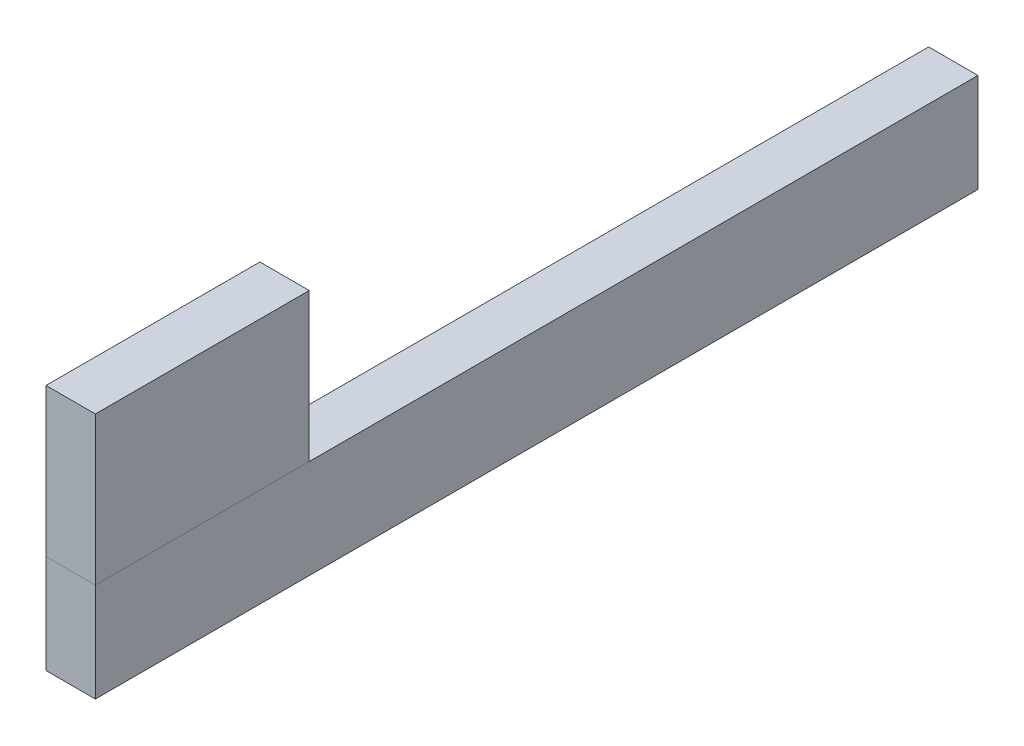
ISO-10303-21;
HEADER;
FILE_DESCRIPTION(('STEP AP214'),'2;1');
FILE_NAME('part.step','',(''),(''),'','','');
FILE_SCHEMA(('AUTOMOTIVE_DESIGN { 1 0 10303 214 1 1 1 1 }'));
ENDSEC;
DATA;
#1=APPLICATION_CONTEXT('core data for automotive mechanical design processes');
#2=APPLICATION_PROTOCOL_DEFINITION('international standard','automotive_design',2000,#1);
#3=PRODUCT_CONTEXT('',#1,'mechanical');
#4=PRODUCT('Part','Part','',(#3));
#5=PRODUCT_RELATED_PRODUCT_CATEGORY('part','',(#4));
#6=PRODUCT_DEFINITION_FORMATION('','',#4);
#7=PRODUCT_DEFINITION_CONTEXT('part definition',#1,'design');
#8=PRODUCT_DEFINITION('design','',#6,#7);
#9=PRODUCT_DEFINITION_SHAPE('','',#8);
#10=(LENGTH_UNIT() NAMED_UNIT(*) SI_UNIT(.MILLI.,.METRE.));
#11=(NAMED_UNIT(*) PLANE_ANGLE_UNIT() SI_UNIT($,.RADIAN.));
#12=(NAMED_UNIT(*) SI_UNIT($,.STERADIAN.) SOLID_ANGLE_UNIT());
#13=UNCERTAINTY_MEASURE_WITH_UNIT(LENGTH_MEASURE(1.E-05),#10,'distance_accuracy_value','');
#14=(GEOMETRIC_REPRESENTATION_CONTEXT(3) GLOBAL_UNCERTAINTY_ASSIGNED_CONTEXT((#13)) GLOBAL_UNIT_ASSIGNED_CONTEXT((#10,
#11,#12)) REPRESENTATION_CONTEXT('',''));
#15=CARTESIAN_POINT('',(0.,0.,0.));
#16=DIRECTION('',(0.,0.,1.));
#17=DIRECTION('',(1.,0.,0.));
#18=AXIS2_PLACEMENT_3D('',#15,#16,#17);
#19=CARTESIAN_POINT('',(-12.7,101.6,454.));
#20=DIRECTION('',(0.,0.,-1.));
#21=DIRECTION('',(-1.,0.,0.));
#22=AXIS2_PLACEMENT_3D('',#19,#20,#21);
#23=PLANE('',#22);
#24=DIRECTION('',(1.,0.,0.));
#25=VECTOR('',#24,1.);
#26=CARTESIAN_POINT('',(-12.7,25.4,454.));
#27=LINE('',#26,#25);
#28=CARTESIAN_POINT('',(-12.7,25.4,454.));
#29=VERTEX_POINT('',#28);
#30=CARTESIAN_POINT('',(12.7,25.4,454.));
#31=VERTEX_POINT('',#30);
#32=EDGE_CURVE('E106',#29,#31,#27,.T.);
#33=ORIENTED_EDGE('',*,*,#32,.T.);
#34=DIRECTION('',(0.,-1.,0.));
#35=VECTOR('',#34,1.);
#36=CARTESIAN_POINT('',(12.7,101.6,454.));
#37=LINE('',#36,#35);
#38=CARTESIAN_POINT('',(12.7,101.6,454.));
#39=VERTEX_POINT('',#38);
#40=EDGE_CURVE('E12',#39,#31,#37,.T.);
#41=ORIENTED_EDGE('',*,*,#40,.F.);
#42=DIRECTION('',(1.,0.,0.));
#43=VECTOR('',#42,1.);
#44=CARTESIAN_POINT('',(-12.7,101.6,454.));
#45=LINE('',#44,#43);
#46=CARTESIAN_POINT('',(-12.7,101.6,454.));
#47=VERTEX_POINT('',#46);
#48=EDGE_CURVE('E94',#47,#39,#45,.T.);
#49=ORIENTED_EDGE('',*,*,#48,.F.);
#50=DIRECTION('',(0.,-1.,0.));
#51=VECTOR('',#50,1.);
#52=CARTESIAN_POINT('',(-12.7,101.6,454.));
#53=LINE('',#52,#51);
#54=EDGE_CURVE('E102',#47,#29,#53,.T.);
#55=ORIENTED_EDGE('',*,*,#54,.T.);
#56=EDGE_LOOP('',(#33,#41,#49,#55));
#57=FACE_BOUND('',#56,.T.);
#58=ADVANCED_FACE('F43',(#57),#23,.F.);
#59=CARTESIAN_POINT('',(12.7,101.6,454.));
#60=DIRECTION('',(-1.,0.,0.));
#61=DIRECTION('',(0.,0.,1.));
#62=AXIS2_PLACEMENT_3D('',#59,#60,#61);
#63=PLANE('',#62);
#64=DIRECTION('',(0.,0.,-1.));
#65=VECTOR('',#64,1.);
#66=CARTESIAN_POINT('',(12.7,25.4,454.));
#67=LINE('',#66,#65);
#68=CARTESIAN_POINT('',(12.7,25.4,344.));
#69=VERTEX_POINT('',#68);
#70=EDGE_CURVE('E98',#31,#69,#67,.T.);
#71=ORIENTED_EDGE('',*,*,#70,.T.);
#72=DIRECTION('',(0.,-1.,0.));
#73=VECTOR('',#72,1.);
#74=CARTESIAN_POINT('',(12.7,101.6,344.));
#75=LINE('',#74,#73);
#76=CARTESIAN_POINT('',(12.7,101.6,344.));
#77=VERTEX_POINT('',#76);
#78=EDGE_CURVE('E51',#77,#69,#75,.T.);
#79=ORIENTED_EDGE('',*,*,#78,.F.);
#80=DIRECTION('',(0.,0.,-1.));
#81=VECTOR('',#80,1.);
#82=CARTESIAN_POINT('',(12.7,101.6,454.));
#83=LINE('',#82,#81);
#84=EDGE_CURVE('E89',#39,#77,#83,.T.);
#85=ORIENTED_EDGE('',*,*,#84,.F.);
#86=ORIENTED_EDGE('',*,*,#40,.T.);
#87=EDGE_LOOP('',(#71,#79,#85,#86));
#88=FACE_BOUND('',#87,.T.);
#89=ADVANCED_FACE('F97',(#88),#63,.F.);
#90=CARTESIAN_POINT('',(12.7,101.6,344.));
#91=DIRECTION('',(0.,0.,1.));
#92=DIRECTION('',(1.,0.,0.));
#93=AXIS2_PLACEMENT_3D('',#90,#91,#92);
#94=PLANE('',#93);
#95=DIRECTION('',(-1.,0.,0.));
#96=VECTOR('',#95,1.);
#97=CARTESIAN_POINT('',(12.7,25.4,344.));
#98=LINE('',#97,#96);
#99=CARTESIAN_POINT('',(-12.7,25.4,344.));
#100=VERTEX_POINT('',#99);
#101=EDGE_CURVE('E76',#69,#100,#98,.T.);
#102=ORIENTED_EDGE('',*,*,#101,.T.);
#103=DIRECTION('',(0.,-1.,0.));
#104=VECTOR('',#103,1.);
#105=CARTESIAN_POINT('',(-12.7,101.6,344.));
#106=LINE('',#105,#104);
#107=CARTESIAN_POINT('',(-12.7,101.6,344.));
#108=VERTEX_POINT('',#107);
#109=EDGE_CURVE('E99',#108,#100,#106,.T.);
#110=ORIENTED_EDGE('',*,*,#109,.F.);
#111=DIRECTION('',(-1.,0.,0.));
#112=VECTOR('',#111,1.);
#113=CARTESIAN_POINT('',(12.7,101.6,344.));
#114=LINE('',#113,#112);
#115=EDGE_CURVE('E92',#77,#108,#114,.T.);
#116=ORIENTED_EDGE('',*,*,#115,.F.);
#117=ORIENTED_EDGE('',*,*,#78,.T.);
#118=EDGE_LOOP('',(#102,#110,#116,#117));
#119=FACE_BOUND('',#118,.T.);
#120=ADVANCED_FACE('F100',(#119),#94,.F.);
#121=CARTESIAN_POINT('',(-12.7,101.6,344.));
#122=DIRECTION('',(1.,0.,0.));
#123=DIRECTION('',(0.,0.,-1.));
#124=AXIS2_PLACEMENT_3D('',#121,#122,#123);
#125=PLANE('',#124);
#126=DIRECTION('',(0.,0.,1.));
#127=VECTOR('',#126,1.);
#128=CARTESIAN_POINT('',(-12.7,25.4,344.));
#129=LINE('',#128,#127);
#130=EDGE_CURVE('E82',#100,#29,#129,.T.);
#131=ORIENTED_EDGE('',*,*,#130,.T.);
#132=ORIENTED_EDGE('',*,*,#54,.F.);
#133=DIRECTION('',(0.,0.,1.));
#134=VECTOR('',#133,1.);
#135=CARTESIAN_POINT('',(-12.7,101.6,344.));
#136=LINE('',#135,#134);
#137=EDGE_CURVE('E59',#108,#47,#136,.T.);
#138=ORIENTED_EDGE('',*,*,#137,.F.);
#139=ORIENTED_EDGE('',*,*,#109,.T.);
#140=EDGE_LOOP('',(#131,#132,#138,#139));
#141=FACE_BOUND('',#140,.T.);
#142=ADVANCED_FACE('F113',(#141),#125,.F.);
#143=CARTESIAN_POINT('',(0.,101.6,0.));
#144=DIRECTION('',(0.,1.,0.));
#145=DIRECTION('',(0.,0.,1.));
#146=AXIS2_PLACEMENT_3D('',#143,#144,#145);
#147=PLANE('',#146);
#148=ORIENTED_EDGE('',*,*,#48,.T.);
#149=ORIENTED_EDGE('',*,*,#84,.T.);
#150=ORIENTED_EDGE('',*,*,#115,.T.);
#151=ORIENTED_EDGE('',*,*,#137,.T.);
#152=EDGE_LOOP('',(#148,#149,#150,#151));
#153=FACE_BOUND('',#152,.T.);
#154=ADVANCED_FACE('F90',(#153),#147,.T.);
#155=CARTESIAN_POINT('',(0.,25.4,0.));
#156=DIRECTION('',(0.,1.,0.));
#157=DIRECTION('',(0.,0.,1.));
#158=AXIS2_PLACEMENT_3D('',#155,#156,#157);
#159=PLANE('',#158);
#160=ORIENTED_EDGE('',*,*,#32,.F.);
#161=ORIENTED_EDGE('',*,*,#130,.F.);
#162=ORIENTED_EDGE('',*,*,#101,.F.);
#163=ORIENTED_EDGE('',*,*,#70,.F.);
#164=EDGE_LOOP('',(#160,#161,#162,#163));
#165=FACE_BOUND('',#164,.T.);
#166=ADVANCED_FACE('F116',(#165),#159,.F.);
#167=CLOSED_SHELL('',(#58,#89,#120,#142,#154,#166));
#168=MANIFOLD_SOLID_BREP('B2',#167);
#169=CARTESIAN_POINT('',(12.7,25.4,454.));
#170=DIRECTION('',(-1.,0.,0.));
#171=DIRECTION('',(0.,-1.,0.));
#172=AXIS2_PLACEMENT_3D('',#169,#170,#171);
#173=PLANE('',#172);
#174=DIRECTION('',(0.,1.,0.));
#175=VECTOR('',#174,1.);
#176=CARTESIAN_POINT('',(12.7,25.4,0.));
#177=LINE('',#176,#175);
#178=CARTESIAN_POINT('',(12.7,-25.4,0.));
#179=VERTEX_POINT('',#178);
#180=CARTESIAN_POINT('',(12.7,25.4,0.));
#181=VERTEX_POINT('',#180);
#182=EDGE_CURVE('E230',#179,#181,#177,.T.);
#183=ORIENTED_EDGE('',*,*,#182,.T.);
#184=DIRECTION('',(0.,0.,-1.));
#185=VECTOR('',#184,1.);
#186=CARTESIAN_POINT('',(12.7,25.4,454.));
#187=LINE('',#186,#185);
#188=CARTESIAN_POINT('',(12.7,25.4,454.));
#189=VERTEX_POINT('',#188);
#190=EDGE_CURVE('E41',#189,#181,#187,.T.);
#191=ORIENTED_EDGE('',*,*,#190,.F.);
#192=DIRECTION('',(0.,1.,0.));
#193=VECTOR('',#192,1.);
#194=CARTESIAN_POINT('',(12.7,25.4,454.));
#195=LINE('',#194,#193);
#196=CARTESIAN_POINT('',(12.7,-25.4,454.));
#197=VERTEX_POINT('',#196);
#198=EDGE_CURVE('E218',#197,#189,#195,.T.);
#199=ORIENTED_EDGE('',*,*,#198,.F.);
#200=DIRECTION('',(0.,0.,-1.));
#201=VECTOR('',#200,1.);
#202=CARTESIAN_POINT('',(12.7,-25.4,454.));
#203=LINE('',#202,#201);
#204=EDGE_CURVE('E226',#197,#179,#203,.T.);
#205=ORIENTED_EDGE('',*,*,#204,.T.);
#206=EDGE_LOOP('',(#183,#191,#199,#205));
#207=FACE_BOUND('',#206,.T.);
#208=ADVANCED_FACE('F167',(#207),#173,.F.);
#209=CARTESIAN_POINT('',(-12.7,25.4,454.));
#210=DIRECTION('',(0.,-1.,0.));
#211=DIRECTION('',(0.,0.,-1.));
#212=AXIS2_PLACEMENT_3D('',#209,#210,#211);
#213=PLANE('',#212);
#214=DIRECTION('',(-1.,0.,0.));
#215=VECTOR('',#214,1.);
#216=CARTESIAN_POINT('',(-12.7,25.4,0.));
#217=LINE('',#216,#215);
#218=CARTESIAN_POINT('',(-12.7,25.4,0.));
#219=VERTEX_POINT('',#218);
#220=EDGE_CURVE('E222',#181,#219,#217,.T.);
#221=ORIENTED_EDGE('',*,*,#220,.T.);
#222=DIRECTION('',(0.,0.,-1.));
#223=VECTOR('',#222,1.);
#224=CARTESIAN_POINT('',(-12.7,25.4,454.));
#225=LINE('',#224,#223);
#226=CARTESIAN_POINT('',(-12.7,25.4,454.));
#227=VERTEX_POINT('',#226);
#228=EDGE_CURVE('E175',#227,#219,#225,.T.);
#229=ORIENTED_EDGE('',*,*,#228,.F.);
#230=DIRECTION('',(-1.,0.,0.));
#231=VECTOR('',#230,1.);
#232=CARTESIAN_POINT('',(-12.7,25.4,454.));
#233=LINE('',#232,#231);
#234=EDGE_CURVE('E213',#189,#227,#233,.T.);
#235=ORIENTED_EDGE('',*,*,#234,.F.);
#236=ORIENTED_EDGE('',*,*,#190,.T.);
#237=EDGE_LOOP('',(#221,#229,#235,#236));
#238=FACE_BOUND('',#237,.T.);
#239=ADVANCED_FACE('F221',(#238),#213,.F.);
#240=CARTESIAN_POINT('',(-12.7,25.4,454.));
#241=DIRECTION('',(1.,0.,0.));
#242=DIRECTION('',(0.,1.,0.));
#243=AXIS2_PLACEMENT_3D('',#240,#241,#242);
#244=PLANE('',#243);
#245=DIRECTION('',(0.,-1.,0.));
#246=VECTOR('',#245,1.);
#247=CARTESIAN_POINT('',(-12.7,25.4,0.));
#248=LINE('',#247,#246);
#249=CARTESIAN_POINT('',(-12.7,-25.4,0.));
#250=VERTEX_POINT('',#249);
#251=EDGE_CURVE('E200',#219,#250,#248,.T.);
#252=ORIENTED_EDGE('',*,*,#251,.T.);
#253=DIRECTION('',(0.,0.,-1.));
#254=VECTOR('',#253,1.);
#255=CARTESIAN_POINT('',(-12.7,-25.4,454.));
#256=LINE('',#255,#254);
#257=CARTESIAN_POINT('',(-12.7,-25.4,454.));
#258=VERTEX_POINT('',#257);
#259=EDGE_CURVE('E223',#258,#250,#256,.T.);
#260=ORIENTED_EDGE('',*,*,#259,.F.);
#261=DIRECTION('',(0.,-1.,0.));
#262=VECTOR('',#261,1.);
#263=CARTESIAN_POINT('',(-12.7,25.4,454.));
#264=LINE('',#263,#262);
#265=EDGE_CURVE('E216',#227,#258,#264,.T.);
#266=ORIENTED_EDGE('',*,*,#265,.F.);
#267=ORIENTED_EDGE('',*,*,#228,.T.);
#268=EDGE_LOOP('',(#252,#260,#266,#267));
#269=FACE_BOUND('',#268,.T.);
#270=ADVANCED_FACE('F224',(#269),#244,.F.);
#271=CARTESIAN_POINT('',(-12.7,-25.4,454.));
#272=DIRECTION('',(0.,1.,0.));
#273=DIRECTION('',(0.,0.,1.));
#274=AXIS2_PLACEMENT_3D('',#271,#272,#273);
#275=PLANE('',#274);
#276=DIRECTION('',(1.,0.,0.));
#277=VECTOR('',#276,1.);
#278=CARTESIAN_POINT('',(-12.7,-25.4,0.));
#279=LINE('',#278,#277);
#280=EDGE_CURVE('E206',#250,#179,#279,.T.);
#281=ORIENTED_EDGE('',*,*,#280,.T.);
#282=ORIENTED_EDGE('',*,*,#204,.F.);
#283=DIRECTION('',(1.,0.,0.));
#284=VECTOR('',#283,1.);
#285=CARTESIAN_POINT('',(-12.7,-25.4,454.));
#286=LINE('',#285,#284);
#287=EDGE_CURVE('E183',#258,#197,#286,.T.);
#288=ORIENTED_EDGE('',*,*,#287,.F.);
#289=ORIENTED_EDGE('',*,*,#259,.T.);
#290=EDGE_LOOP('',(#281,#282,#288,#289));
#291=FACE_BOUND('',#290,.T.);
#292=ADVANCED_FACE('F237',(#291),#275,.F.);
#293=CARTESIAN_POINT('',(0.,0.,454.));
#294=DIRECTION('',(0.,0.,1.));
#295=DIRECTION('',(1.,0.,0.));
#296=AXIS2_PLACEMENT_3D('',#293,#294,#295);
#297=PLANE('',#296);
#298=ORIENTED_EDGE('',*,*,#198,.T.);
#299=ORIENTED_EDGE('',*,*,#234,.T.);
#300=ORIENTED_EDGE('',*,*,#265,.T.);
#301=ORIENTED_EDGE('',*,*,#287,.T.);
#302=EDGE_LOOP('',(#298,#299,#300,#301));
#303=FACE_BOUND('',#302,.T.);
#304=ADVANCED_FACE('F214',(#303),#297,.T.);
#305=CARTESIAN_POINT('',(0.,0.,0.));
#306=DIRECTION('',(0.,0.,1.));
#307=DIRECTION('',(1.,0.,0.));
#308=AXIS2_PLACEMENT_3D('',#305,#306,#307);
#309=PLANE('',#308);
#310=ORIENTED_EDGE('',*,*,#182,.F.);
#311=ORIENTED_EDGE('',*,*,#280,.F.);
#312=ORIENTED_EDGE('',*,*,#251,.F.);
#313=ORIENTED_EDGE('',*,*,#220,.F.);
#314=EDGE_LOOP('',(#310,#311,#312,#313));
#315=FACE_BOUND('',#314,.T.);
#316=ADVANCED_FACE('F240',(#315),#309,.F.);
#317=CLOSED_SHELL('',(#208,#239,#270,#292,#304,#316));
#318=MANIFOLD_SOLID_BREP('B6',#317);
#319=ADVANCED_BREP_SHAPE_REPRESENTATION('',(#18,#168,#318),#14);
#320=SHAPE_DEFINITION_REPRESENTATION(#9,#319);
ENDSEC;
END-ISO-10303-21;
